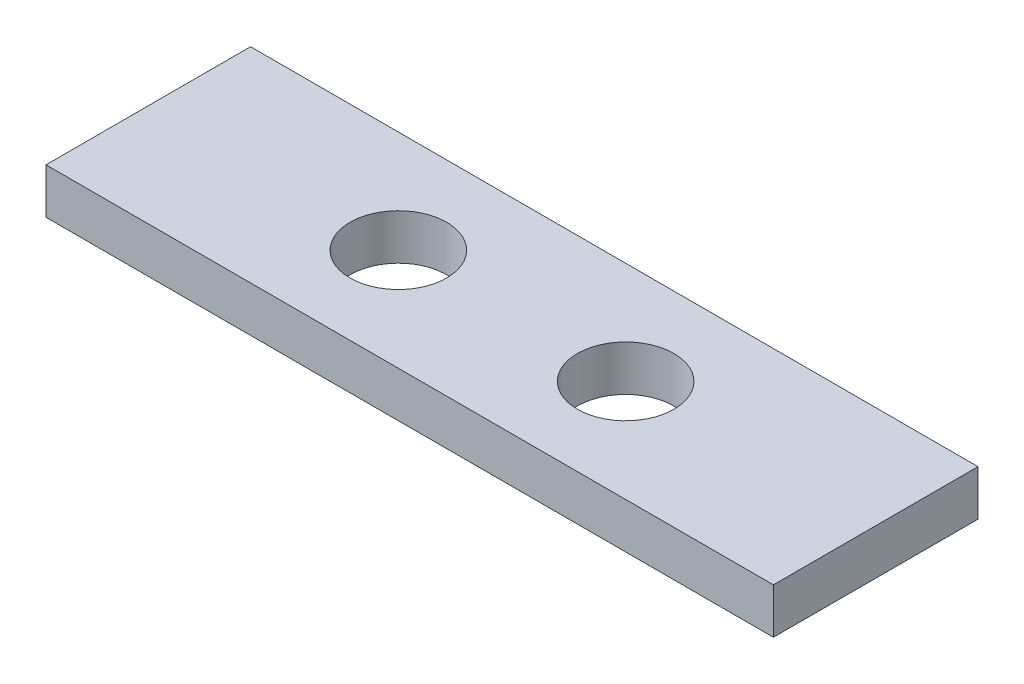
ISO-10303-21;
HEADER;
FILE_DESCRIPTION(('STEP AP214'),'2;1');
FILE_NAME('part.step','',(''),(''),'','','');
FILE_SCHEMA(('AUTOMOTIVE_DESIGN { 1 0 10303 214 1 1 1 1 }'));
ENDSEC;
DATA;
#1=APPLICATION_CONTEXT('core data for automotive mechanical design processes');
#2=APPLICATION_PROTOCOL_DEFINITION('international standard','automotive_design',2000,#1);
#3=PRODUCT_CONTEXT('',#1,'mechanical');
#4=PRODUCT('Part','Part','',(#3));
#5=PRODUCT_RELATED_PRODUCT_CATEGORY('part','',(#4));
#6=PRODUCT_DEFINITION_FORMATION('','',#4);
#7=PRODUCT_DEFINITION_CONTEXT('part definition',#1,'design');
#8=PRODUCT_DEFINITION('design','',#6,#7);
#9=PRODUCT_DEFINITION_SHAPE('','',#8);
#10=(LENGTH_UNIT() NAMED_UNIT(*) SI_UNIT(.MILLI.,.METRE.));
#11=(NAMED_UNIT(*) PLANE_ANGLE_UNIT() SI_UNIT($,.RADIAN.));
#12=(NAMED_UNIT(*) SI_UNIT($,.STERADIAN.) SOLID_ANGLE_UNIT());
#13=UNCERTAINTY_MEASURE_WITH_UNIT(LENGTH_MEASURE(1.E-05),#10,'distance_accuracy_value','');
#14=(GEOMETRIC_REPRESENTATION_CONTEXT(3) GLOBAL_UNCERTAINTY_ASSIGNED_CONTEXT((#13)) GLOBAL_UNIT_ASSIGNED_CONTEXT((#10,
#11,#12)) REPRESENTATION_CONTEXT('',''));
#15=CARTESIAN_POINT('',(0.,0.,0.));
#16=DIRECTION('',(0.,0.,1.));
#17=DIRECTION('',(1.,0.,0.));
#18=AXIS2_PLACEMENT_3D('',#15,#16,#17);
#19=CARTESIAN_POINT('',(50.8,-3.175,-14.2875));
#20=DIRECTION('',(0.,0.,1.));
#21=DIRECTION('',(1.,0.,0.));
#22=AXIS2_PLACEMENT_3D('',#19,#20,#21);
#23=PLANE('',#22);
#24=DIRECTION('',(-1.,0.,0.));
#25=VECTOR('',#24,1.);
#26=CARTESIAN_POINT('',(50.8,-3.175,-14.2875));
#27=LINE('',#26,#25);
#28=CARTESIAN_POINT('',(50.8,-3.175,-14.2875));
#29=VERTEX_POINT('',#28);
#30=CARTESIAN_POINT('',(-50.8,-3.175,-14.2875));
#31=VERTEX_POINT('',#30);
#32=EDGE_CURVE('E90',#29,#31,#27,.T.);
#33=ORIENTED_EDGE('',*,*,#32,.T.);
#34=DIRECTION('',(0.,1.,0.));
#35=VECTOR('',#34,1.);
#36=CARTESIAN_POINT('',(-50.8,-3.175,-14.2875));
#37=LINE('',#36,#35);
#38=CARTESIAN_POINT('',(-50.8,3.175,-14.2875));
#39=VERTEX_POINT('',#38);
#40=EDGE_CURVE('E85',#31,#39,#37,.T.);
#41=ORIENTED_EDGE('',*,*,#40,.T.);
#42=DIRECTION('',(-1.,0.,0.));
#43=VECTOR('',#42,1.);
#44=CARTESIAN_POINT('',(50.8,3.175,-14.2875));
#45=LINE('',#44,#43);
#46=CARTESIAN_POINT('',(50.8,3.175,-14.2875));
#47=VERTEX_POINT('',#46);
#48=EDGE_CURVE('E11',#47,#39,#45,.T.);
#49=ORIENTED_EDGE('',*,*,#48,.F.);
#50=DIRECTION('',(0.,1.,0.));
#51=VECTOR('',#50,1.);
#52=CARTESIAN_POINT('',(50.8,-3.175,-14.2875));
#53=LINE('',#52,#51);
#54=EDGE_CURVE('E101',#29,#47,#53,.T.);
#55=ORIENTED_EDGE('',*,*,#54,.F.);
#56=EDGE_LOOP('',(#33,#41,#49,#55));
#57=FACE_BOUND('',#56,.T.);
#58=ADVANCED_FACE('F33',(#57),#23,.F.);
#59=CARTESIAN_POINT('',(50.8,3.175,14.2875));
#60=DIRECTION('',(0.,-1.,0.));
#61=DIRECTION('',(0.,0.,-1.));
#62=AXIS2_PLACEMENT_3D('',#59,#60,#61);
#63=PLANE('',#62);
#64=CARTESIAN_POINT('',(-15.875,3.175,0.));
#65=DIRECTION('',(0.,1.,0.));
#66=DIRECTION('',(0.,0.,1.));
#67=AXIS2_PLACEMENT_3D('',#64,#65,#66);
#68=CIRCLE('',#67,6.74623999999999);
#69=CARTESIAN_POINT('',(-15.875,3.175,6.74623999999999));
#70=VERTEX_POINT('',#69);
#71=EDGE_CURVE('E135',#70,#70,#68,.T.);
#72=ORIENTED_EDGE('',*,*,#71,.F.);
#73=EDGE_LOOP('',(#72));
#74=FACE_BOUND('',#73,.T.);
#75=CARTESIAN_POINT('',(15.875,3.175,0.));
#76=DIRECTION('',(0.,1.,0.));
#77=DIRECTION('',(0.,0.,1.));
#78=AXIS2_PLACEMENT_3D('',#75,#76,#77);
#79=CIRCLE('',#78,6.74623999999999);
#80=CARTESIAN_POINT('',(15.875,3.175,6.74623999999999));
#81=VERTEX_POINT('',#80);
#82=EDGE_CURVE('E94',#81,#81,#79,.T.);
#83=ORIENTED_EDGE('',*,*,#82,.F.);
#84=EDGE_LOOP('',(#83));
#85=FACE_BOUND('',#84,.T.);
#86=ORIENTED_EDGE('',*,*,#48,.T.);
#87=DIRECTION('',(0.,0.,1.));
#88=VECTOR('',#87,1.);
#89=CARTESIAN_POINT('',(-50.8,3.175,14.2875));
#90=LINE('',#89,#88);
#91=CARTESIAN_POINT('',(-50.8,3.175,14.2875));
#92=VERTEX_POINT('',#91);
#93=EDGE_CURVE('E75',#39,#92,#90,.T.);
#94=ORIENTED_EDGE('',*,*,#93,.T.);
#95=DIRECTION('',(-1.,0.,0.));
#96=VECTOR('',#95,1.);
#97=CARTESIAN_POINT('',(50.8,3.175,14.2875));
#98=LINE('',#97,#96);
#99=CARTESIAN_POINT('',(50.8,3.175,14.2875));
#100=VERTEX_POINT('',#99);
#101=EDGE_CURVE('E40',#100,#92,#98,.T.);
#102=ORIENTED_EDGE('',*,*,#101,.F.);
#103=DIRECTION('',(0.,0.,1.));
#104=VECTOR('',#103,1.);
#105=CARTESIAN_POINT('',(50.8,3.175,14.2875));
#106=LINE('',#105,#104);
#107=EDGE_CURVE('E76',#47,#100,#106,.T.);
#108=ORIENTED_EDGE('',*,*,#107,.F.);
#109=EDGE_LOOP('',(#86,#94,#102,#108));
#110=FACE_BOUND('',#109,.T.);
#111=ADVANCED_FACE('F73',(#74,#85,#110),#63,.F.);
#112=CARTESIAN_POINT('',(50.8,-3.175,14.2875));
#113=DIRECTION('',(0.,0.,-1.));
#114=DIRECTION('',(-1.,0.,0.));
#115=AXIS2_PLACEMENT_3D('',#112,#113,#114);
#116=PLANE('',#115);
#117=ORIENTED_EDGE('',*,*,#101,.T.);
#118=DIRECTION('',(0.,-1.,0.));
#119=VECTOR('',#118,1.);
#120=CARTESIAN_POINT('',(-50.8,-3.175,14.2875));
#121=LINE('',#120,#119);
#122=CARTESIAN_POINT('',(-50.8,-3.175,14.2875));
#123=VERTEX_POINT('',#122);
#124=EDGE_CURVE('E88',#92,#123,#121,.T.);
#125=ORIENTED_EDGE('',*,*,#124,.T.);
#126=DIRECTION('',(-1.,0.,0.));
#127=VECTOR('',#126,1.);
#128=CARTESIAN_POINT('',(50.8,-3.175,14.2875));
#129=LINE('',#128,#127);
#130=CARTESIAN_POINT('',(50.8,-3.175,14.2875));
#131=VERTEX_POINT('',#130);
#132=EDGE_CURVE('E107',#131,#123,#129,.T.);
#133=ORIENTED_EDGE('',*,*,#132,.F.);
#134=DIRECTION('',(0.,-1.,0.));
#135=VECTOR('',#134,1.);
#136=CARTESIAN_POINT('',(50.8,-3.175,14.2875));
#137=LINE('',#136,#135);
#138=EDGE_CURVE('E52',#100,#131,#137,.T.);
#139=ORIENTED_EDGE('',*,*,#138,.F.);
#140=EDGE_LOOP('',(#117,#125,#133,#139));
#141=FACE_BOUND('',#140,.T.);
#142=ADVANCED_FACE('F109',(#141),#116,.F.);
#143=CARTESIAN_POINT('',(50.8,-3.175,14.2875));
#144=DIRECTION('',(0.,1.,0.));
#145=DIRECTION('',(0.,0.,1.));
#146=AXIS2_PLACEMENT_3D('',#143,#144,#145);
#147=PLANE('',#146);
#148=CARTESIAN_POINT('',(-15.875,-3.175,0.));
#149=DIRECTION('',(0.,1.,0.));
#150=DIRECTION('',(0.,0.,1.));
#151=AXIS2_PLACEMENT_3D('',#148,#149,#150);
#152=CIRCLE('',#151,6.74623999999999);
#153=CARTESIAN_POINT('',(-15.875,-3.175,6.74623999999999));
#154=VERTEX_POINT('',#153);
#155=EDGE_CURVE('E139',#154,#154,#152,.T.);
#156=ORIENTED_EDGE('',*,*,#155,.T.);
#157=EDGE_LOOP('',(#156));
#158=FACE_BOUND('',#157,.T.);
#159=CARTESIAN_POINT('',(15.875,-3.175,0.));
#160=DIRECTION('',(0.,1.,0.));
#161=DIRECTION('',(0.,0.,1.));
#162=AXIS2_PLACEMENT_3D('',#159,#160,#161);
#163=CIRCLE('',#162,6.74623999999999);
#164=CARTESIAN_POINT('',(15.875,-3.175,6.74623999999999));
#165=VERTEX_POINT('',#164);
#166=EDGE_CURVE('E91',#165,#165,#163,.T.);
#167=ORIENTED_EDGE('',*,*,#166,.T.);
#168=EDGE_LOOP('',(#167));
#169=FACE_BOUND('',#168,.T.);
#170=ORIENTED_EDGE('',*,*,#132,.T.);
#171=DIRECTION('',(0.,0.,-1.));
#172=VECTOR('',#171,1.);
#173=CARTESIAN_POINT('',(-50.8,-3.175,14.2875));
#174=LINE('',#173,#172);
#175=EDGE_CURVE('E99',#123,#31,#174,.T.);
#176=ORIENTED_EDGE('',*,*,#175,.T.);
#177=ORIENTED_EDGE('',*,*,#32,.F.);
#178=DIRECTION('',(0.,0.,-1.));
#179=VECTOR('',#178,1.);
#180=CARTESIAN_POINT('',(50.8,-3.175,14.2875));
#181=LINE('',#180,#179);
#182=EDGE_CURVE('E47',#131,#29,#181,.T.);
#183=ORIENTED_EDGE('',*,*,#182,.F.);
#184=EDGE_LOOP('',(#170,#176,#177,#183));
#185=FACE_BOUND('',#184,.T.);
#186=ADVANCED_FACE('F111',(#158,#169,#185),#147,.F.);
#187=CARTESIAN_POINT('',(50.8,3.175,-14.2875));
#188=DIRECTION('',(-1.,0.,0.));
#189=DIRECTION('',(0.,0.,1.));
#190=AXIS2_PLACEMENT_3D('',#187,#188,#189);
#191=PLANE('',#190);
#192=ORIENTED_EDGE('',*,*,#54,.T.);
#193=ORIENTED_EDGE('',*,*,#107,.T.);
#194=ORIENTED_EDGE('',*,*,#138,.T.);
#195=ORIENTED_EDGE('',*,*,#182,.T.);
#196=EDGE_LOOP('',(#192,#193,#194,#195));
#197=FACE_BOUND('',#196,.T.);
#198=ADVANCED_FACE('F112',(#197),#191,.F.);
#199=CARTESIAN_POINT('',(-50.8,3.175,-14.2875));
#200=DIRECTION('',(-1.,0.,0.));
#201=DIRECTION('',(0.,0.,1.));
#202=AXIS2_PLACEMENT_3D('',#199,#200,#201);
#203=PLANE('',#202);
#204=ORIENTED_EDGE('',*,*,#40,.F.);
#205=ORIENTED_EDGE('',*,*,#175,.F.);
#206=ORIENTED_EDGE('',*,*,#124,.F.);
#207=ORIENTED_EDGE('',*,*,#93,.F.);
#208=EDGE_LOOP('',(#204,#205,#206,#207));
#209=FACE_BOUND('',#208,.T.);
#210=ADVANCED_FACE('F83',(#209),#203,.T.);
#211=CARTESIAN_POINT('',(15.875,3.175,0.));
#212=DIRECTION('',(0.,1.,0.));
#213=DIRECTION('',(0.,0.,1.));
#214=AXIS2_PLACEMENT_3D('',#211,#212,#213);
#215=CYLINDRICAL_SURFACE('',#214,6.74623999999999);
#216=ORIENTED_EDGE('',*,*,#166,.F.);
#217=EDGE_LOOP('',(#216));
#218=FACE_BOUND('',#217,.T.);
#219=ORIENTED_EDGE('',*,*,#82,.T.);
#220=EDGE_LOOP('',(#219));
#221=FACE_BOUND('',#220,.T.);
#222=ADVANCED_FACE('F119',(#218,#221),#215,.F.);
#223=CARTESIAN_POINT('',(-15.875,3.175,0.));
#224=DIRECTION('',(0.,1.,0.));
#225=DIRECTION('',(0.,0.,1.));
#226=AXIS2_PLACEMENT_3D('',#223,#224,#225);
#227=CYLINDRICAL_SURFACE('',#226,6.74623999999999);
#228=ORIENTED_EDGE('',*,*,#155,.F.);
#229=EDGE_LOOP('',(#228));
#230=FACE_BOUND('',#229,.T.);
#231=ORIENTED_EDGE('',*,*,#71,.T.);
#232=EDGE_LOOP('',(#231));
#233=FACE_BOUND('',#232,.T.);
#234=ADVANCED_FACE('F144',(#230,#233),#227,.F.);
#235=CLOSED_SHELL('',(#58,#111,#142,#186,#198,#210,#222,#234));
#236=MANIFOLD_SOLID_BREP('B2',#235);
#237=ADVANCED_BREP_SHAPE_REPRESENTATION('',(#18,#236),#14);
#238=SHAPE_DEFINITION_REPRESENTATION(#9,#237);
ENDSEC;
END-ISO-10303-21;
